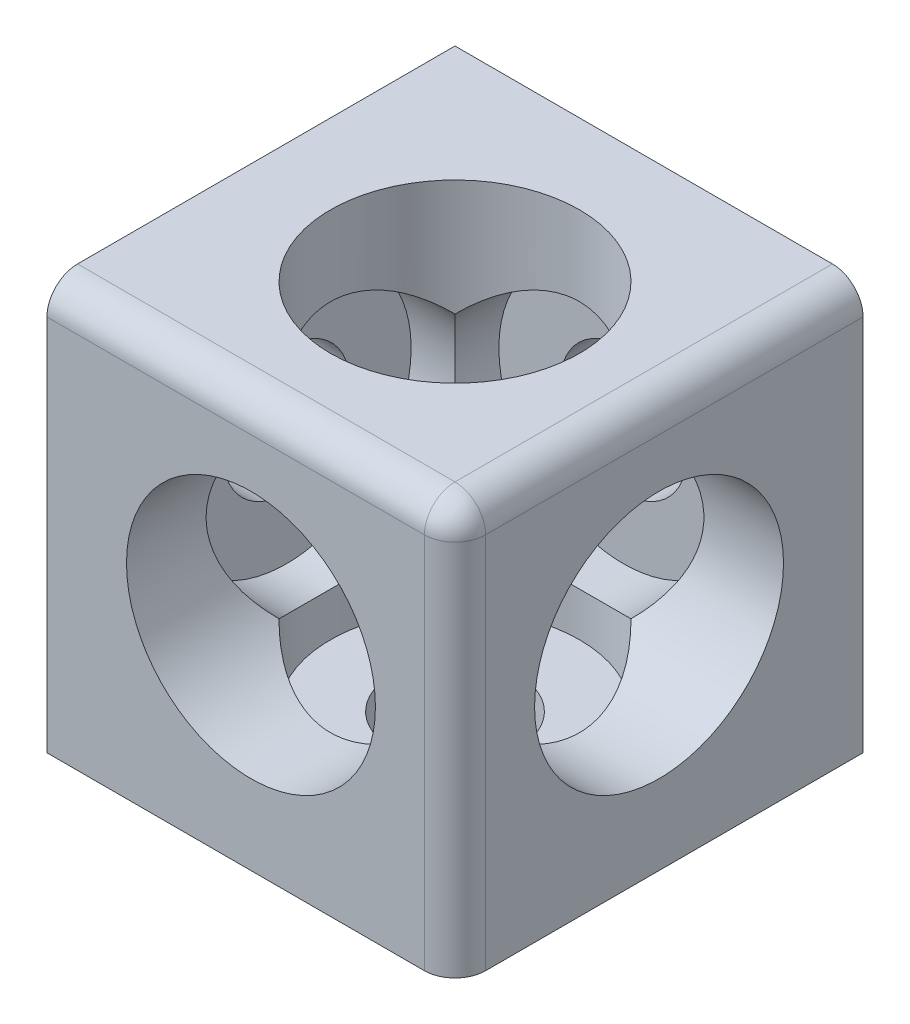
ISO-10303-21;
HEADER;
FILE_DESCRIPTION(('STEP AP214'),'2;1');
FILE_NAME('part.step','',(''),(''),'','','');
FILE_SCHEMA(('AUTOMOTIVE_DESIGN { 1 0 10303 214 1 1 1 1 }'));
ENDSEC;
DATA;
#1=APPLICATION_CONTEXT('core data for automotive mechanical design processes');
#2=APPLICATION_PROTOCOL_DEFINITION('international standard','automotive_design',2000,#1);
#3=PRODUCT_CONTEXT('',#1,'mechanical');
#4=PRODUCT('Part','Part','',(#3));
#5=PRODUCT_RELATED_PRODUCT_CATEGORY('part','',(#4));
#6=PRODUCT_DEFINITION_FORMATION('','',#4);
#7=PRODUCT_DEFINITION_CONTEXT('part definition',#1,'design');
#8=PRODUCT_DEFINITION('design','',#6,#7);
#9=PRODUCT_DEFINITION_SHAPE('','',#8);
#10=(LENGTH_UNIT() NAMED_UNIT(*) SI_UNIT(.MILLI.,.METRE.));
#11=(NAMED_UNIT(*) PLANE_ANGLE_UNIT() SI_UNIT($,.RADIAN.));
#12=(NAMED_UNIT(*) SI_UNIT($,.STERADIAN.) SOLID_ANGLE_UNIT());
#13=UNCERTAINTY_MEASURE_WITH_UNIT(LENGTH_MEASURE(1.E-05),#10,'distance_accuracy_value','');
#14=(GEOMETRIC_REPRESENTATION_CONTEXT(3) GLOBAL_UNCERTAINTY_ASSIGNED_CONTEXT((#13)) GLOBAL_UNIT_ASSIGNED_CONTEXT((#10,
#11,#12)) REPRESENTATION_CONTEXT('',''));
#15=CARTESIAN_POINT('',(0.,0.,0.));
#16=DIRECTION('',(0.,0.,1.));
#17=DIRECTION('',(1.,0.,0.));
#18=AXIS2_PLACEMENT_3D('',#15,#16,#17);
#19=CARTESIAN_POINT('',(20.,0.,1.75));
#20=DIRECTION('',(0.,0.,-1.));
#21=DIRECTION('',(-1.,0.,0.));
#22=AXIS2_PLACEMENT_3D('',#19,#20,#21);
#23=CYLINDRICAL_SURFACE('',#22,12.2);
#24=CARTESIAN_POINT('',(20.,0.,-16.5));
#25=DIRECTION('',(0.,0.,-1.));
#26=DIRECTION('',(-1.,0.,0.));
#27=AXIS2_PLACEMENT_3D('',#24,#25,#26);
#28=CIRCLE('',#27,12.2);
#29=CARTESIAN_POINT('',(7.80000000000001,0.,-16.5));
#30=VERTEX_POINT('',#29);
#31=EDGE_CURVE('E19',#30,#30,#28,.T.);
#32=ORIENTED_EDGE('',*,*,#31,.T.);
#33=EDGE_LOOP('',(#32));
#34=FACE_BOUND('',#33,.T.);
#35=CARTESIAN_POINT('',(20.,0.,0.));
#36=DIRECTION('',(0.,0.707106781186547,-0.707106781186548));
#37=DIRECTION('',(0.,-0.707106781186548,-0.707106781186547));
#38=AXIS2_PLACEMENT_3D('',#35,#36,#37);
#39=ELLIPSE('',#38,17.2534054609518,12.2);
#40=CARTESIAN_POINT('',(11.3732972695241,-8.62670273047588,-8.62670273047588));
#41=VERTEX_POINT('',#40);
#42=CARTESIAN_POINT('',(28.6267027304759,-8.62670273047588,-8.62670273047588));
#43=VERTEX_POINT('',#42);
#44=EDGE_CURVE('E106',#41,#43,#39,.F.);
#45=ORIENTED_EDGE('',*,*,#44,.T.);
#46=CARTESIAN_POINT('',(20.,0.,0.));
#47=DIRECTION('',(-0.707106781186547,0.,-0.707106781186548));
#48=DIRECTION('',(0.707106781186548,0.,-0.707106781186547));
#49=AXIS2_PLACEMENT_3D('',#46,#47,#48);
#50=ELLIPSE('',#49,17.2534054609518,12.2);
#51=CARTESIAN_POINT('',(28.6267027304759,8.62670273047588,-8.62670273047588));
#52=VERTEX_POINT('',#51);
#53=EDGE_CURVE('E88',#43,#52,#50,.F.);
#54=ORIENTED_EDGE('',*,*,#53,.T.);
#55=CARTESIAN_POINT('',(20.,0.,0.));
#56=DIRECTION('',(0.,-0.707106781186548,-0.707106781186547));
#57=DIRECTION('',(0.,0.707106781186547,-0.707106781186548));
#58=AXIS2_PLACEMENT_3D('',#55,#56,#57);
#59=ELLIPSE('',#58,17.2534054609518,12.2);
#60=CARTESIAN_POINT('',(11.3732972695241,8.62670273047588,-8.62670273047588));
#61=VERTEX_POINT('',#60);
#62=EDGE_CURVE('E99',#52,#61,#59,.F.);
#63=ORIENTED_EDGE('',*,*,#62,.T.);
#64=CARTESIAN_POINT('',(20.,0.,0.));
#65=DIRECTION('',(0.707106781186548,0.,-0.707106781186547));
#66=DIRECTION('',(-0.707106781186547,0.,-0.707106781186548));
#67=AXIS2_PLACEMENT_3D('',#64,#65,#66);
#68=ELLIPSE('',#67,17.2534054609518,12.2);
#69=EDGE_CURVE('E116',#61,#41,#68,.F.);
#70=ORIENTED_EDGE('',*,*,#69,.T.);
#71=EDGE_LOOP('',(#45,#54,#63,#70));
#72=FACE_BOUND('',#71,.T.);
#73=ADVANCED_FACE('F15',(#34,#72),#23,.F.);
#74=CARTESIAN_POINT('',(20.,0.,-16.5));
#75=DIRECTION('',(0.,0.,-1.));
#76=DIRECTION('',(-1.,0.,0.));
#77=AXIS2_PLACEMENT_3D('',#74,#75,#76);
#78=PLANE('',#77);
#79=CARTESIAN_POINT('',(20.,0.,-16.5));
#80=DIRECTION('',(0.,0.,1.));
#81=DIRECTION('',(1.,0.,0.));
#82=AXIS2_PLACEMENT_3D('',#79,#80,#81);
#83=CIRCLE('',#82,6.2);
#84=CARTESIAN_POINT('',(26.2,0.,-16.5));
#85=VERTEX_POINT('',#84);
#86=EDGE_CURVE('E95',#85,#85,#83,.F.);
#87=ORIENTED_EDGE('',*,*,#86,.T.);
#88=EDGE_LOOP('',(#87));
#89=FACE_BOUND('',#88,.T.);
#90=ORIENTED_EDGE('',*,*,#31,.F.);
#91=EDGE_LOOP('',(#90));
#92=FACE_BOUND('',#91,.T.);
#93=ADVANCED_FACE('F263',(#89,#92),#78,.F.);
#94=CARTESIAN_POINT('',(3.5,0.,0.));
#95=DIRECTION('',(-1.,0.,0.));
#96=DIRECTION('',(0.,0.,1.));
#97=AXIS2_PLACEMENT_3D('',#94,#95,#96);
#98=PLANE('',#97);
#99=CARTESIAN_POINT('',(3.5,0.,0.));
#100=DIRECTION('',(1.,0.,0.));
#101=DIRECTION('',(0.,0.,-1.));
#102=AXIS2_PLACEMENT_3D('',#99,#100,#101);
#103=CIRCLE('',#102,6.2);
#104=CARTESIAN_POINT('',(3.5,0.,-6.2));
#105=VERTEX_POINT('',#104);
#106=EDGE_CURVE('E211',#105,#105,#103,.F.);
#107=ORIENTED_EDGE('',*,*,#106,.T.);
#108=EDGE_LOOP('',(#107));
#109=FACE_BOUND('',#108,.T.);
#110=CARTESIAN_POINT('',(3.5,0.,0.));
#111=DIRECTION('',(-1.,0.,0.));
#112=DIRECTION('',(0.,0.,1.));
#113=AXIS2_PLACEMENT_3D('',#110,#111,#112);
#114=CIRCLE('',#113,12.2);
#115=CARTESIAN_POINT('',(3.5,0.,12.2));
#116=VERTEX_POINT('',#115);
#117=EDGE_CURVE('E118',#116,#116,#114,.F.);
#118=ORIENTED_EDGE('',*,*,#117,.T.);
#119=EDGE_LOOP('',(#118));
#120=FACE_BOUND('',#119,.T.);
#121=ADVANCED_FACE('F123',(#109,#120),#98,.F.);
#122=CARTESIAN_POINT('',(20.,1.75,0.));
#123=DIRECTION('',(0.,-1.,0.));
#124=DIRECTION('',(0.,0.,-1.));
#125=AXIS2_PLACEMENT_3D('',#122,#123,#124);
#126=CYLINDRICAL_SURFACE('',#125,12.2);
#127=CARTESIAN_POINT('',(20.,0.,0.));
#128=DIRECTION('',(0.,-0.707106781186547,0.707106781186548));
#129=DIRECTION('',(0.,-0.707106781186548,-0.707106781186547));
#130=AXIS2_PLACEMENT_3D('',#127,#128,#129);
#131=ELLIPSE('',#130,17.2534054609518,12.2);
#132=CARTESIAN_POINT('',(28.6267027304759,8.62670273047587,8.62670273047588));
#133=VERTEX_POINT('',#132);
#134=CARTESIAN_POINT('',(11.3732972695241,8.62670273047588,8.62670273047587));
#135=VERTEX_POINT('',#134);
#136=EDGE_CURVE('E255',#133,#135,#131,.T.);
#137=ORIENTED_EDGE('',*,*,#136,.T.);
#138=CARTESIAN_POINT('',(20.,0.,0.));
#139=DIRECTION('',(-0.707106781186547,-0.707106781186547,0.));
#140=DIRECTION('',(0.707106781186547,-0.707106781186547,0.));
#141=AXIS2_PLACEMENT_3D('',#138,#139,#140);
#142=ELLIPSE('',#141,17.2534054609518,12.2);
#143=EDGE_CURVE('E102',#135,#61,#142,.T.);
#144=ORIENTED_EDGE('',*,*,#143,.T.);
#145=ORIENTED_EDGE('',*,*,#62,.F.);
#146=CARTESIAN_POINT('',(20.,0.,0.));
#147=DIRECTION('',(0.707106781186547,-0.707106781186547,0.));
#148=DIRECTION('',(-0.707106781186547,-0.707106781186547,0.));
#149=AXIS2_PLACEMENT_3D('',#146,#147,#148);
#150=ELLIPSE('',#149,17.2534054609518,12.2);
#151=EDGE_CURVE('E83',#52,#133,#150,.T.);
#152=ORIENTED_EDGE('',*,*,#151,.T.);
#153=EDGE_LOOP('',(#137,#144,#145,#152));
#154=FACE_BOUND('',#153,.T.);
#155=CARTESIAN_POINT('',(20.,20.,0.));
#156=DIRECTION('',(0.,-1.,0.));
#157=DIRECTION('',(0.,0.,-1.));
#158=AXIS2_PLACEMENT_3D('',#155,#156,#157);
#159=CIRCLE('',#158,12.2);
#160=CARTESIAN_POINT('',(20.,20.,-12.2));
#161=VERTEX_POINT('',#160);
#162=EDGE_CURVE('E212',#161,#161,#159,.F.);
#163=ORIENTED_EDGE('',*,*,#162,.T.);
#164=EDGE_LOOP('',(#163));
#165=FACE_BOUND('',#164,.T.);
#166=ADVANCED_FACE('F100',(#154,#165),#126,.F.);
#167=CARTESIAN_POINT('',(21.75,0.,0.));
#168=DIRECTION('',(-1.,0.,0.));
#169=DIRECTION('',(0.,0.,1.));
#170=AXIS2_PLACEMENT_3D('',#167,#168,#169);
#171=CYLINDRICAL_SURFACE('',#170,12.2);
#172=ORIENTED_EDGE('',*,*,#69,.F.);
#173=ORIENTED_EDGE('',*,*,#143,.F.);
#174=CARTESIAN_POINT('',(20.,0.,0.));
#175=DIRECTION('',(-0.707106781186547,0.,-0.707106781186548));
#176=DIRECTION('',(-0.707106781186548,0.,0.707106781186547));
#177=AXIS2_PLACEMENT_3D('',#174,#175,#176);
#178=ELLIPSE('',#177,17.2534054609518,12.2);
#179=CARTESIAN_POINT('',(11.3732972695241,-8.62670273047588,8.62670273047588));
#180=VERTEX_POINT('',#179);
#181=EDGE_CURVE('E252',#135,#180,#178,.F.);
#182=ORIENTED_EDGE('',*,*,#181,.T.);
#183=CARTESIAN_POINT('',(20.,0.,0.));
#184=DIRECTION('',(-0.707106781186547,0.707106781186547,0.));
#185=DIRECTION('',(-0.707106781186547,-0.707106781186547,0.));
#186=AXIS2_PLACEMENT_3D('',#183,#184,#185);
#187=ELLIPSE('',#186,17.2534054609518,12.2);
#188=EDGE_CURVE('E110',#180,#41,#187,.F.);
#189=ORIENTED_EDGE('',*,*,#188,.T.);
#190=EDGE_LOOP('',(#172,#173,#182,#189));
#191=FACE_BOUND('',#190,.T.);
#192=ORIENTED_EDGE('',*,*,#117,.F.);
#193=EDGE_LOOP('',(#192));
#194=FACE_BOUND('',#193,.T.);
#195=ADVANCED_FACE('F125',(#191,#194),#171,.F.);
#196=CARTESIAN_POINT('',(20.,1.75,0.));
#197=DIRECTION('',(0.,-1.,0.));
#198=DIRECTION('',(0.,0.,-1.));
#199=AXIS2_PLACEMENT_3D('',#196,#197,#198);
#200=CYLINDRICAL_SURFACE('',#199,12.2);
#201=CARTESIAN_POINT('',(20.,-16.5,0.));
#202=DIRECTION('',(0.,-1.,0.));
#203=DIRECTION('',(0.,0.,-1.));
#204=AXIS2_PLACEMENT_3D('',#201,#202,#203);
#205=CIRCLE('',#204,12.2);
#206=CARTESIAN_POINT('',(20.,-16.5,-12.2));
#207=VERTEX_POINT('',#206);
#208=EDGE_CURVE('E216',#207,#207,#205,.T.);
#209=ORIENTED_EDGE('',*,*,#208,.T.);
#210=EDGE_LOOP('',(#209));
#211=FACE_BOUND('',#210,.T.);
#212=ORIENTED_EDGE('',*,*,#44,.F.);
#213=ORIENTED_EDGE('',*,*,#188,.F.);
#214=CARTESIAN_POINT('',(20.,0.,0.));
#215=DIRECTION('',(0.,-0.707106781186548,-0.707106781186547));
#216=DIRECTION('',(0.,-0.707106781186547,0.707106781186548));
#217=AXIS2_PLACEMENT_3D('',#214,#215,#216);
#218=ELLIPSE('',#217,17.2534054609518,12.2);
#219=CARTESIAN_POINT('',(28.6267027304759,-8.62670273047587,8.62670273047588));
#220=VERTEX_POINT('',#219);
#221=EDGE_CURVE('E249',#180,#220,#218,.F.);
#222=ORIENTED_EDGE('',*,*,#221,.T.);
#223=CARTESIAN_POINT('',(20.,0.,0.));
#224=DIRECTION('',(-0.707106781186547,-0.707106781186547,0.));
#225=DIRECTION('',(0.707106781186547,-0.707106781186547,0.));
#226=AXIS2_PLACEMENT_3D('',#223,#224,#225);
#227=ELLIPSE('',#226,17.2534054609518,12.2);
#228=EDGE_CURVE('E108',#220,#43,#227,.F.);
#229=ORIENTED_EDGE('',*,*,#228,.T.);
#230=EDGE_LOOP('',(#212,#213,#222,#229));
#231=FACE_BOUND('',#230,.T.);
#232=ADVANCED_FACE('F127',(#211,#231),#200,.F.);
#233=CARTESIAN_POINT('',(21.75,0.,0.));
#234=DIRECTION('',(-1.,0.,0.));
#235=DIRECTION('',(0.,0.,1.));
#236=AXIS2_PLACEMENT_3D('',#233,#234,#235);
#237=CYLINDRICAL_SURFACE('',#236,12.2);
#238=ORIENTED_EDGE('',*,*,#53,.F.);
#239=ORIENTED_EDGE('',*,*,#228,.F.);
#240=CARTESIAN_POINT('',(20.,0.,0.));
#241=DIRECTION('',(-0.707106781186548,0.,0.707106781186547));
#242=DIRECTION('',(-0.707106781186547,0.,-0.707106781186548));
#243=AXIS2_PLACEMENT_3D('',#240,#241,#242);
#244=ELLIPSE('',#243,17.2534054609518,12.2);
#245=EDGE_CURVE('E91',#220,#133,#244,.T.);
#246=ORIENTED_EDGE('',*,*,#245,.T.);
#247=ORIENTED_EDGE('',*,*,#151,.F.);
#248=EDGE_LOOP('',(#238,#239,#246,#247));
#249=FACE_BOUND('',#248,.T.);
#250=CARTESIAN_POINT('',(40.,0.,0.));
#251=DIRECTION('',(-1.,0.,0.));
#252=DIRECTION('',(0.,0.,1.));
#253=AXIS2_PLACEMENT_3D('',#250,#251,#252);
#254=CIRCLE('',#253,12.2);
#255=CARTESIAN_POINT('',(40.,0.,12.2));
#256=VERTEX_POINT('',#255);
#257=EDGE_CURVE('E186',#256,#256,#254,.F.);
#258=ORIENTED_EDGE('',*,*,#257,.T.);
#259=EDGE_LOOP('',(#258));
#260=FACE_BOUND('',#259,.T.);
#261=ADVANCED_FACE('F85',(#249,#260),#237,.F.);
#262=CARTESIAN_POINT('',(37.,17.,0.));
#263=DIRECTION('',(0.,0.,-1.));
#264=DIRECTION('',(0.,1.,0.));
#265=AXIS2_PLACEMENT_3D('',#262,#263,#264);
#266=CYLINDRICAL_SURFACE('',#265,3.);
#267=DIRECTION('',(0.,0.,1.));
#268=VECTOR('',#267,1.);
#269=CARTESIAN_POINT('',(40.,17.,0.));
#270=LINE('',#269,#268);
#271=CARTESIAN_POINT('',(40.,17.,17.));
#272=VERTEX_POINT('',#271);
#273=CARTESIAN_POINT('',(40.,17.,-20.));
#274=VERTEX_POINT('',#273);
#275=EDGE_CURVE('E187',#272,#274,#270,.F.);
#276=ORIENTED_EDGE('',*,*,#275,.T.);
#277=CARTESIAN_POINT('',(37.,17.,-20.));
#278=DIRECTION('',(0.,0.,-1.));
#279=DIRECTION('',(0.,1.,0.));
#280=AXIS2_PLACEMENT_3D('',#277,#278,#279);
#281=CIRCLE('',#280,3.);
#282=CARTESIAN_POINT('',(37.,20.,-20.));
#283=VERTEX_POINT('',#282);
#284=EDGE_CURVE('E240',#274,#283,#281,.F.);
#285=ORIENTED_EDGE('',*,*,#284,.T.);
#286=DIRECTION('',(0.,0.,-1.));
#287=VECTOR('',#286,1.);
#288=CARTESIAN_POINT('',(37.,20.,0.));
#289=LINE('',#288,#287);
#290=CARTESIAN_POINT('',(37.,20.,17.));
#291=VERTEX_POINT('',#290);
#292=EDGE_CURVE('E219',#283,#291,#289,.F.);
#293=ORIENTED_EDGE('',*,*,#292,.T.);
#294=CARTESIAN_POINT('',(37.,17.,17.));
#295=DIRECTION('',(0.,0.,1.));
#296=DIRECTION('',(1.,0.,0.));
#297=AXIS2_PLACEMENT_3D('',#294,#295,#296);
#298=CIRCLE('',#297,3.);
#299=EDGE_CURVE('E206',#272,#291,#298,.T.);
#300=ORIENTED_EDGE('',*,*,#299,.F.);
#301=EDGE_LOOP('',(#276,#285,#293,#300));
#302=FACE_BOUND('',#301,.T.);
#303=ADVANCED_FACE('F270',(#302),#266,.T.);
#304=CARTESIAN_POINT('',(20.,0.,-17.5));
#305=DIRECTION('',(0.,0.,1.));
#306=DIRECTION('',(1.,0.,0.));
#307=AXIS2_PLACEMENT_3D('',#304,#305,#306);
#308=CYLINDRICAL_SURFACE('',#307,6.2);
#309=ORIENTED_EDGE('',*,*,#86,.F.);
#310=EDGE_LOOP('',(#309));
#311=FACE_BOUND('',#310,.T.);
#312=CARTESIAN_POINT('',(20.,0.,-20.));
#313=DIRECTION('',(0.,0.,1.));
#314=DIRECTION('',(1.,0.,0.));
#315=AXIS2_PLACEMENT_3D('',#312,#313,#314);
#316=CIRCLE('',#315,6.2);
#317=CARTESIAN_POINT('',(26.2,0.,-20.));
#318=VERTEX_POINT('',#317);
#319=EDGE_CURVE('E178',#318,#318,#316,.F.);
#320=ORIENTED_EDGE('',*,*,#319,.T.);
#321=EDGE_LOOP('',(#320));
#322=FACE_BOUND('',#321,.T.);
#323=ADVANCED_FACE('F266',(#311,#322),#308,.F.);
#324=CARTESIAN_POINT('',(20.,20.,0.));
#325=DIRECTION('',(0.,-1.,0.));
#326=DIRECTION('',(0.,0.,-1.));
#327=AXIS2_PLACEMENT_3D('',#324,#325,#326);
#328=PLANE('',#327);
#329=ORIENTED_EDGE('',*,*,#162,.F.);
#330=EDGE_LOOP('',(#329));
#331=FACE_BOUND('',#330,.T.);
#332=ORIENTED_EDGE('',*,*,#292,.F.);
#333=DIRECTION('',(1.,0.,0.));
#334=VECTOR('',#333,1.);
#335=CARTESIAN_POINT('',(20.,20.,-20.));
#336=LINE('',#335,#334);
#337=CARTESIAN_POINT('',(0.,20.,-20.));
#338=VERTEX_POINT('',#337);
#339=EDGE_CURVE('E245',#283,#338,#336,.F.);
#340=ORIENTED_EDGE('',*,*,#339,.T.);
#341=DIRECTION('',(0.,0.,-1.));
#342=VECTOR('',#341,1.);
#343=CARTESIAN_POINT('',(0.,20.,0.));
#344=LINE('',#343,#342);
#345=CARTESIAN_POINT('',(0.,20.,17.));
#346=VERTEX_POINT('',#345);
#347=EDGE_CURVE('E177',#338,#346,#344,.F.);
#348=ORIENTED_EDGE('',*,*,#347,.T.);
#349=DIRECTION('',(-1.,0.,0.));
#350=VECTOR('',#349,1.);
#351=CARTESIAN_POINT('',(20.,20.,17.));
#352=LINE('',#351,#350);
#353=EDGE_CURVE('E209',#291,#346,#352,.T.);
#354=ORIENTED_EDGE('',*,*,#353,.F.);
#355=EDGE_LOOP('',(#332,#340,#348,#354));
#356=FACE_BOUND('',#355,.T.);
#357=ADVANCED_FACE('F269',(#331,#356),#328,.F.);
#358=CARTESIAN_POINT('',(2.5,0.,0.));
#359=DIRECTION('',(1.,0.,0.));
#360=DIRECTION('',(0.,0.,-1.));
#361=AXIS2_PLACEMENT_3D('',#358,#359,#360);
#362=CYLINDRICAL_SURFACE('',#361,6.2);
#363=ORIENTED_EDGE('',*,*,#106,.F.);
#364=EDGE_LOOP('',(#363));
#365=FACE_BOUND('',#364,.T.);
#366=CARTESIAN_POINT('',(0.,0.,0.));
#367=DIRECTION('',(1.,0.,0.));
#368=DIRECTION('',(0.,0.,-1.));
#369=AXIS2_PLACEMENT_3D('',#366,#367,#368);
#370=CIRCLE('',#369,6.2);
#371=CARTESIAN_POINT('',(0.,0.,-6.2));
#372=VERTEX_POINT('',#371);
#373=EDGE_CURVE('E193',#372,#372,#370,.F.);
#374=ORIENTED_EDGE('',*,*,#373,.T.);
#375=EDGE_LOOP('',(#374));
#376=FACE_BOUND('',#375,.T.);
#377=ADVANCED_FACE('F356',(#365,#376),#362,.F.);
#378=CARTESIAN_POINT('',(20.,17.,17.));
#379=DIRECTION('',(-1.,0.,0.));
#380=DIRECTION('',(0.,0.,1.));
#381=AXIS2_PLACEMENT_3D('',#378,#379,#380);
#382=CYLINDRICAL_SURFACE('',#381,3.);
#383=DIRECTION('',(1.,0.,0.));
#384=VECTOR('',#383,1.);
#385=CARTESIAN_POINT('',(20.,17.,20.));
#386=LINE('',#385,#384);
#387=CARTESIAN_POINT('',(37.,17.,20.));
#388=VERTEX_POINT('',#387);
#389=CARTESIAN_POINT('',(0.,17.,20.));
#390=VERTEX_POINT('',#389);
#391=EDGE_CURVE('E190',#388,#390,#386,.F.);
#392=ORIENTED_EDGE('',*,*,#391,.F.);
#393=CARTESIAN_POINT('',(37.,17.,17.));
#394=DIRECTION('',(1.,0.,0.));
#395=DIRECTION('',(0.,1.,0.));
#396=AXIS2_PLACEMENT_3D('',#393,#394,#395);
#397=CIRCLE('',#396,3.);
#398=EDGE_CURVE('E203',#291,#388,#397,.T.);
#399=ORIENTED_EDGE('',*,*,#398,.F.);
#400=ORIENTED_EDGE('',*,*,#353,.T.);
#401=CARTESIAN_POINT('',(0.,17.,17.));
#402=DIRECTION('',(-1.,0.,0.));
#403=DIRECTION('',(0.,0.,1.));
#404=AXIS2_PLACEMENT_3D('',#401,#402,#403);
#405=CIRCLE('',#404,3.);
#406=EDGE_CURVE('E236',#346,#390,#405,.F.);
#407=ORIENTED_EDGE('',*,*,#406,.T.);
#408=EDGE_LOOP('',(#392,#399,#400,#407));
#409=FACE_BOUND('',#408,.T.);
#410=ADVANCED_FACE('F300',(#409),#382,.T.);
#411=CARTESIAN_POINT('',(20.,0.,1.75));
#412=DIRECTION('',(0.,0.,-1.));
#413=DIRECTION('',(-1.,0.,0.));
#414=AXIS2_PLACEMENT_3D('',#411,#412,#413);
#415=CYLINDRICAL_SURFACE('',#414,12.2);
#416=CARTESIAN_POINT('',(20.,0.,20.));
#417=DIRECTION('',(0.,0.,-1.));
#418=DIRECTION('',(-1.,0.,0.));
#419=AXIS2_PLACEMENT_3D('',#416,#417,#418);
#420=CIRCLE('',#419,12.2);
#421=CARTESIAN_POINT('',(7.8,0.,20.));
#422=VERTEX_POINT('',#421);
#423=EDGE_CURVE('E200',#422,#422,#420,.T.);
#424=ORIENTED_EDGE('',*,*,#423,.F.);
#425=EDGE_LOOP('',(#424));
#426=FACE_BOUND('',#425,.T.);
#427=ORIENTED_EDGE('',*,*,#136,.F.);
#428=ORIENTED_EDGE('',*,*,#245,.F.);
#429=ORIENTED_EDGE('',*,*,#221,.F.);
#430=ORIENTED_EDGE('',*,*,#181,.F.);
#431=EDGE_LOOP('',(#427,#428,#429,#430));
#432=FACE_BOUND('',#431,.T.);
#433=ADVANCED_FACE('F328',(#426,#432),#415,.F.);
#434=CARTESIAN_POINT('',(37.,17.,17.));
#435=DIRECTION('',(1.,0.,0.));
#436=DIRECTION('',(0.,1.,0.));
#437=AXIS2_PLACEMENT_3D('',#434,#435,#436);
#438=SPHERICAL_SURFACE('',#437,3.);
#439=CARTESIAN_POINT('',(37.,17.,17.));
#440=DIRECTION('',(0.,1.,0.));
#441=DIRECTION('',(0.,0.,1.));
#442=AXIS2_PLACEMENT_3D('',#439,#440,#441);
#443=CIRCLE('',#442,3.);
#444=EDGE_CURVE('E196',#272,#388,#443,.F.);
#445=ORIENTED_EDGE('',*,*,#444,.F.);
#446=ORIENTED_EDGE('',*,*,#299,.T.);
#447=ORIENTED_EDGE('',*,*,#398,.T.);
#448=EDGE_LOOP('',(#445,#446,#447));
#449=FACE_BOUND('',#448,.T.);
#450=ADVANCED_FACE('F323',(#449),#438,.T.);
#451=CARTESIAN_POINT('',(20.,-16.5,0.));
#452=DIRECTION('',(0.,-1.,0.));
#453=DIRECTION('',(0.,0.,-1.));
#454=AXIS2_PLACEMENT_3D('',#451,#452,#453);
#455=PLANE('',#454);
#456=CARTESIAN_POINT('',(20.,-16.5,0.));
#457=DIRECTION('',(0.,1.,0.));
#458=DIRECTION('',(0.,0.,1.));
#459=AXIS2_PLACEMENT_3D('',#456,#457,#458);
#460=CIRCLE('',#459,6.2);
#461=CARTESIAN_POINT('',(20.,-16.5,6.2));
#462=VERTEX_POINT('',#461);
#463=EDGE_CURVE('E229',#462,#462,#460,.F.);
#464=ORIENTED_EDGE('',*,*,#463,.T.);
#465=EDGE_LOOP('',(#464));
#466=FACE_BOUND('',#465,.T.);
#467=ORIENTED_EDGE('',*,*,#208,.F.);
#468=EDGE_LOOP('',(#467));
#469=FACE_BOUND('',#468,.T.);
#470=ADVANCED_FACE('F327',(#466,#469),#455,.F.);
#471=CARTESIAN_POINT('',(40.,0.,0.));
#472=DIRECTION('',(-1.,0.,0.));
#473=DIRECTION('',(0.,0.,1.));
#474=AXIS2_PLACEMENT_3D('',#471,#472,#473);
#475=PLANE('',#474);
#476=ORIENTED_EDGE('',*,*,#257,.F.);
#477=EDGE_LOOP('',(#476));
#478=FACE_BOUND('',#477,.T.);
#479=DIRECTION('',(0.,0.,1.));
#480=VECTOR('',#479,1.);
#481=CARTESIAN_POINT('',(40.,-20.,0.));
#482=LINE('',#481,#480);
#483=CARTESIAN_POINT('',(40.,-20.,17.));
#484=VERTEX_POINT('',#483);
#485=CARTESIAN_POINT('',(40.,-20.,-20.));
#486=VERTEX_POINT('',#485);
#487=EDGE_CURVE('E168',#484,#486,#482,.F.);
#488=ORIENTED_EDGE('',*,*,#487,.T.);
#489=DIRECTION('',(0.,1.,0.));
#490=VECTOR('',#489,1.);
#491=CARTESIAN_POINT('',(40.,0.,-20.));
#492=LINE('',#491,#490);
#493=EDGE_CURVE('E242',#486,#274,#492,.T.);
#494=ORIENTED_EDGE('',*,*,#493,.T.);
#495=ORIENTED_EDGE('',*,*,#275,.F.);
#496=DIRECTION('',(0.,1.,0.));
#497=VECTOR('',#496,1.);
#498=CARTESIAN_POINT('',(40.,0.,17.));
#499=LINE('',#498,#497);
#500=EDGE_CURVE('E183',#484,#272,#499,.T.);
#501=ORIENTED_EDGE('',*,*,#500,.F.);
#502=EDGE_LOOP('',(#488,#494,#495,#501));
#503=FACE_BOUND('',#502,.T.);
#504=ADVANCED_FACE('F277',(#478,#503),#475,.F.);
#505=CARTESIAN_POINT('',(20.,0.,-20.));
#506=DIRECTION('',(0.,0.,1.));
#507=DIRECTION('',(1.,0.,0.));
#508=AXIS2_PLACEMENT_3D('',#505,#506,#507);
#509=PLANE('',#508);
#510=ORIENTED_EDGE('',*,*,#319,.F.);
#511=EDGE_LOOP('',(#510));
#512=FACE_BOUND('',#511,.T.);
#513=ORIENTED_EDGE('',*,*,#493,.F.);
#514=DIRECTION('',(1.,0.,0.));
#515=VECTOR('',#514,1.);
#516=CARTESIAN_POINT('',(20.,-20.,-20.));
#517=LINE('',#516,#515);
#518=CARTESIAN_POINT('',(0.,-20.,-20.));
#519=VERTEX_POINT('',#518);
#520=EDGE_CURVE('E166',#486,#519,#517,.F.);
#521=ORIENTED_EDGE('',*,*,#520,.T.);
#522=DIRECTION('',(0.,1.,0.));
#523=VECTOR('',#522,1.);
#524=CARTESIAN_POINT('',(0.,0.,-20.));
#525=LINE('',#524,#523);
#526=EDGE_CURVE('E165',#519,#338,#525,.T.);
#527=ORIENTED_EDGE('',*,*,#526,.T.);
#528=ORIENTED_EDGE('',*,*,#339,.F.);
#529=ORIENTED_EDGE('',*,*,#284,.F.);
#530=EDGE_LOOP('',(#513,#521,#527,#528,#529));
#531=FACE_BOUND('',#530,.T.);
#532=ADVANCED_FACE('F274',(#512,#531),#509,.F.);
#533=CARTESIAN_POINT('',(0.,0.,0.));
#534=DIRECTION('',(1.,0.,0.));
#535=DIRECTION('',(0.,0.,-1.));
#536=AXIS2_PLACEMENT_3D('',#533,#534,#535);
#537=PLANE('',#536);
#538=ORIENTED_EDGE('',*,*,#373,.F.);
#539=EDGE_LOOP('',(#538));
#540=FACE_BOUND('',#539,.T.);
#541=ORIENTED_EDGE('',*,*,#347,.F.);
#542=ORIENTED_EDGE('',*,*,#526,.F.);
#543=DIRECTION('',(0.,0.,1.));
#544=VECTOR('',#543,1.);
#545=CARTESIAN_POINT('',(0.,-20.,0.));
#546=LINE('',#545,#544);
#547=CARTESIAN_POINT('',(0.,-20.,20.));
#548=VERTEX_POINT('',#547);
#549=EDGE_CURVE('E152',#519,#548,#546,.T.);
#550=ORIENTED_EDGE('',*,*,#549,.T.);
#551=DIRECTION('',(0.,1.,0.));
#552=VECTOR('',#551,1.);
#553=CARTESIAN_POINT('',(0.,0.,20.));
#554=LINE('',#553,#552);
#555=EDGE_CURVE('E163',#390,#548,#554,.F.);
#556=ORIENTED_EDGE('',*,*,#555,.F.);
#557=ORIENTED_EDGE('',*,*,#406,.F.);
#558=EDGE_LOOP('',(#541,#542,#550,#556,#557));
#559=FACE_BOUND('',#558,.T.);
#560=ADVANCED_FACE('F161',(#540,#559),#537,.F.);
#561=CARTESIAN_POINT('',(20.,0.,20.));
#562=DIRECTION('',(0.,0.,1.));
#563=DIRECTION('',(1.,0.,0.));
#564=AXIS2_PLACEMENT_3D('',#561,#562,#563);
#565=PLANE('',#564);
#566=ORIENTED_EDGE('',*,*,#423,.T.);
#567=EDGE_LOOP('',(#566));
#568=FACE_BOUND('',#567,.T.);
#569=DIRECTION('',(1.,0.,0.));
#570=VECTOR('',#569,1.);
#571=CARTESIAN_POINT('',(20.,-20.,20.));
#572=LINE('',#571,#570);
#573=CARTESIAN_POINT('',(37.,-20.,20.));
#574=VERTEX_POINT('',#573);
#575=EDGE_CURVE('E25',#548,#574,#572,.T.);
#576=ORIENTED_EDGE('',*,*,#575,.T.);
#577=DIRECTION('',(0.,1.,0.));
#578=VECTOR('',#577,1.);
#579=CARTESIAN_POINT('',(37.,0.,20.));
#580=LINE('',#579,#578);
#581=EDGE_CURVE('E199',#388,#574,#580,.F.);
#582=ORIENTED_EDGE('',*,*,#581,.F.);
#583=ORIENTED_EDGE('',*,*,#391,.T.);
#584=ORIENTED_EDGE('',*,*,#555,.T.);
#585=EDGE_LOOP('',(#576,#582,#583,#584));
#586=FACE_BOUND('',#585,.T.);
#587=ADVANCED_FACE('F296',(#568,#586),#565,.T.);
#588=CARTESIAN_POINT('',(37.,0.,17.));
#589=DIRECTION('',(0.,1.,0.));
#590=DIRECTION('',(0.,0.,1.));
#591=AXIS2_PLACEMENT_3D('',#588,#589,#590);
#592=CYLINDRICAL_SURFACE('',#591,3.);
#593=ORIENTED_EDGE('',*,*,#581,.T.);
#594=CARTESIAN_POINT('',(37.,-20.,17.));
#595=DIRECTION('',(0.,1.,0.));
#596=DIRECTION('',(0.,0.,1.));
#597=AXIS2_PLACEMENT_3D('',#594,#595,#596);
#598=CIRCLE('',#597,3.);
#599=EDGE_CURVE('E34',#574,#484,#598,.T.);
#600=ORIENTED_EDGE('',*,*,#599,.T.);
#601=ORIENTED_EDGE('',*,*,#500,.T.);
#602=ORIENTED_EDGE('',*,*,#444,.T.);
#603=EDGE_LOOP('',(#593,#600,#601,#602));
#604=FACE_BOUND('',#603,.T.);
#605=ADVANCED_FACE('F145',(#604),#592,.T.);
#606=CARTESIAN_POINT('',(20.,-17.5,0.));
#607=DIRECTION('',(0.,1.,0.));
#608=DIRECTION('',(0.,0.,1.));
#609=AXIS2_PLACEMENT_3D('',#606,#607,#608);
#610=CYLINDRICAL_SURFACE('',#609,6.2);
#611=ORIENTED_EDGE('',*,*,#463,.F.);
#612=EDGE_LOOP('',(#611));
#613=FACE_BOUND('',#612,.T.);
#614=CARTESIAN_POINT('',(20.,-20.,0.));
#615=DIRECTION('',(0.,1.,0.));
#616=DIRECTION('',(0.,0.,1.));
#617=AXIS2_PLACEMENT_3D('',#614,#615,#616);
#618=CIRCLE('',#617,6.2);
#619=CARTESIAN_POINT('',(20.,-20.,6.2));
#620=VERTEX_POINT('',#619);
#621=EDGE_CURVE('E9',#620,#620,#618,.F.);
#622=ORIENTED_EDGE('',*,*,#621,.T.);
#623=EDGE_LOOP('',(#622));
#624=FACE_BOUND('',#623,.T.);
#625=ADVANCED_FACE('F140',(#613,#624),#610,.F.);
#626=CARTESIAN_POINT('',(20.,-20.,0.));
#627=DIRECTION('',(0.,1.,0.));
#628=DIRECTION('',(0.,0.,1.));
#629=AXIS2_PLACEMENT_3D('',#626,#627,#628);
#630=PLANE('',#629);
#631=ORIENTED_EDGE('',*,*,#621,.F.);
#632=EDGE_LOOP('',(#631));
#633=FACE_BOUND('',#632,.T.);
#634=ORIENTED_EDGE('',*,*,#575,.F.);
#635=ORIENTED_EDGE('',*,*,#549,.F.);
#636=ORIENTED_EDGE('',*,*,#520,.F.);
#637=ORIENTED_EDGE('',*,*,#487,.F.);
#638=ORIENTED_EDGE('',*,*,#599,.F.);
#639=EDGE_LOOP('',(#634,#635,#636,#637,#638));
#640=FACE_BOUND('',#639,.T.);
#641=ADVANCED_FACE('F17',(#633,#640),#630,.F.);
#642=CLOSED_SHELL('',(#73,#93,#121,#166,#195,#232,#261,#303,#323,#357,#377,#410,#433,#450,#470,
#504,#532,#560,#587,#605,#625,#641));
#643=MANIFOLD_SOLID_BREP('B1',#642);
#644=ADVANCED_BREP_SHAPE_REPRESENTATION('',(#18,#643),#14);
#645=SHAPE_DEFINITION_REPRESENTATION(#9,#644);
ENDSEC;
END-ISO-10303-21;
